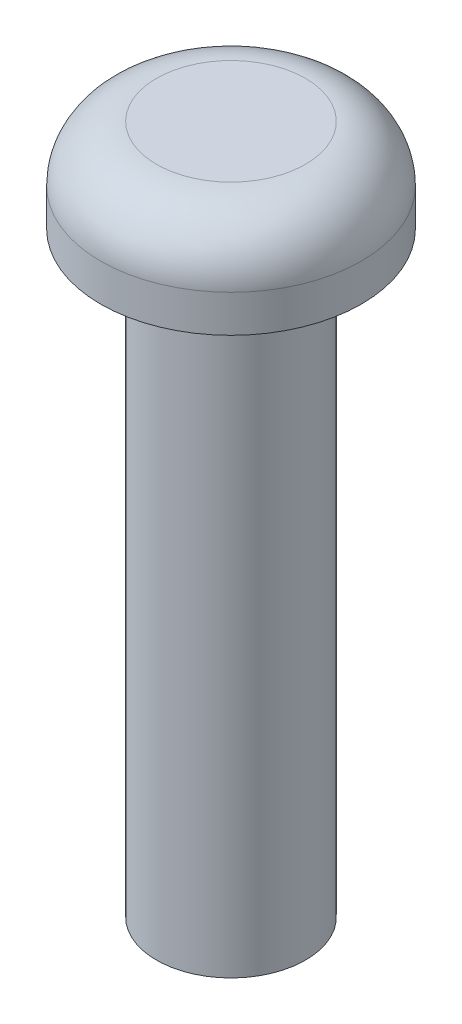
ISO-10303-21;
HEADER;
FILE_DESCRIPTION(('STEP AP214'),'2;1');
FILE_NAME('part.step','',(''),(''),'','','');
FILE_SCHEMA(('AUTOMOTIVE_DESIGN { 1 0 10303 214 1 1 1 1 }'));
ENDSEC;
DATA;
#1=APPLICATION_CONTEXT('core data for automotive mechanical design processes');
#2=APPLICATION_PROTOCOL_DEFINITION('international standard','automotive_design',2000,#1);
#3=PRODUCT_CONTEXT('',#1,'mechanical');
#4=PRODUCT('Part','Part','',(#3));
#5=PRODUCT_RELATED_PRODUCT_CATEGORY('part','',(#4));
#6=PRODUCT_DEFINITION_FORMATION('','',#4);
#7=PRODUCT_DEFINITION_CONTEXT('part definition',#1,'design');
#8=PRODUCT_DEFINITION('design','',#6,#7);
#9=PRODUCT_DEFINITION_SHAPE('','',#8);
#10=(LENGTH_UNIT() NAMED_UNIT(*) SI_UNIT(.MILLI.,.METRE.));
#11=(NAMED_UNIT(*) PLANE_ANGLE_UNIT() SI_UNIT($,.RADIAN.));
#12=(NAMED_UNIT(*) SI_UNIT($,.STERADIAN.) SOLID_ANGLE_UNIT());
#13=UNCERTAINTY_MEASURE_WITH_UNIT(LENGTH_MEASURE(1.E-05),#10,'distance_accuracy_value','');
#14=(GEOMETRIC_REPRESENTATION_CONTEXT(3) GLOBAL_UNCERTAINTY_ASSIGNED_CONTEXT((#13)) GLOBAL_UNIT_ASSIGNED_CONTEXT((#10,
#11,#12)) REPRESENTATION_CONTEXT('',''));
#15=CARTESIAN_POINT('',(0.,0.,0.));
#16=DIRECTION('',(0.,0.,1.));
#17=DIRECTION('',(1.,0.,0.));
#18=AXIS2_PLACEMENT_3D('',#15,#16,#17);
#19=CARTESIAN_POINT('',(0.,-16.,0.));
#20=DIRECTION('',(0.,-1.,0.));
#21=DIRECTION('',(0.,0.,-1.));
#22=AXIS2_PLACEMENT_3D('',#19,#20,#21);
#23=CYLINDRICAL_SURFACE('',#22,2.);
#24=CARTESIAN_POINT('',(0.,0.,0.));
#25=DIRECTION('',(0.,-1.,0.));
#26=DIRECTION('',(0.,0.,-1.));
#27=AXIS2_PLACEMENT_3D('',#24,#25,#26);
#28=CIRCLE('',#27,2.);
#29=CARTESIAN_POINT('',(0.,0.,-2.));
#30=VERTEX_POINT('',#29);
#31=EDGE_CURVE('E10',#30,#30,#28,.T.);
#32=ORIENTED_EDGE('',*,*,#31,.T.);
#33=EDGE_LOOP('',(#32));
#34=FACE_BOUND('',#33,.T.);
#35=CARTESIAN_POINT('',(0.,-16.,0.));
#36=DIRECTION('',(0.,-1.,0.));
#37=DIRECTION('',(0.,0.,-1.));
#38=AXIS2_PLACEMENT_3D('',#35,#36,#37);
#39=CIRCLE('',#38,2.);
#40=CARTESIAN_POINT('',(0.,-16.,-2.));
#41=VERTEX_POINT('',#40);
#42=EDGE_CURVE('E50',#41,#41,#39,.T.);
#43=ORIENTED_EDGE('',*,*,#42,.F.);
#44=EDGE_LOOP('',(#43));
#45=FACE_BOUND('',#44,.T.);
#46=ADVANCED_FACE('F31',(#34,#45),#23,.T.);
#47=CARTESIAN_POINT('',(2.,0.,0.));
#48=DIRECTION('',(0.,-1.,0.));
#49=DIRECTION('',(0.,0.,-1.));
#50=AXIS2_PLACEMENT_3D('',#47,#48,#49);
#51=PLANE('',#50);
#52=CARTESIAN_POINT('',(0.,0.,0.));
#53=DIRECTION('',(0.,-1.,0.));
#54=DIRECTION('',(0.,0.,-1.));
#55=AXIS2_PLACEMENT_3D('',#52,#53,#54);
#56=CIRCLE('',#55,3.5);
#57=CARTESIAN_POINT('',(0.,0.,-3.5));
#58=VERTEX_POINT('',#57);
#59=EDGE_CURVE('E37',#58,#58,#56,.T.);
#60=ORIENTED_EDGE('',*,*,#59,.T.);
#61=EDGE_LOOP('',(#60));
#62=FACE_BOUND('',#61,.T.);
#63=ORIENTED_EDGE('',*,*,#31,.F.);
#64=EDGE_LOOP('',(#63));
#65=FACE_BOUND('',#64,.T.);
#66=ADVANCED_FACE('F57',(#62,#65),#51,.T.);
#67=CARTESIAN_POINT('',(0.,-16.,0.));
#68=DIRECTION('',(0.,-1.,0.));
#69=DIRECTION('',(0.,0.,-1.));
#70=AXIS2_PLACEMENT_3D('',#67,#68,#69);
#71=CYLINDRICAL_SURFACE('',#70,3.5);
#72=CARTESIAN_POINT('',(0.,1.,0.));
#73=DIRECTION('',(0.,-1.,0.));
#74=DIRECTION('',(0.,0.,-1.));
#75=AXIS2_PLACEMENT_3D('',#72,#73,#74);
#76=CIRCLE('',#75,3.5);
#77=CARTESIAN_POINT('',(0.,1.,-3.5));
#78=VERTEX_POINT('',#77);
#79=EDGE_CURVE('E41',#78,#78,#76,.T.);
#80=ORIENTED_EDGE('',*,*,#79,.T.);
#81=EDGE_LOOP('',(#80));
#82=FACE_BOUND('',#81,.T.);
#83=ORIENTED_EDGE('',*,*,#59,.F.);
#84=EDGE_LOOP('',(#83));
#85=FACE_BOUND('',#84,.T.);
#86=ADVANCED_FACE('F61',(#82,#85),#71,.T.);
#87=CARTESIAN_POINT('',(0.,1.,0.));
#88=DIRECTION('',(0.,-1.,0.));
#89=DIRECTION('',(0.,0.,-1.));
#90=AXIS2_PLACEMENT_3D('',#87,#88,#89);
#91=TOROIDAL_SURFACE('',#90,2.,1.5);
#92=CARTESIAN_POINT('',(0.,2.5,0.));
#93=DIRECTION('',(0.,-1.,0.));
#94=DIRECTION('',(0.,0.,-1.));
#95=AXIS2_PLACEMENT_3D('',#92,#93,#94);
#96=CIRCLE('',#95,2.);
#97=CARTESIAN_POINT('',(0.,2.5,-2.));
#98=VERTEX_POINT('',#97);
#99=EDGE_CURVE('E45',#98,#98,#96,.T.);
#100=ORIENTED_EDGE('',*,*,#99,.T.);
#101=EDGE_LOOP('',(#100));
#102=FACE_BOUND('',#101,.T.);
#103=ORIENTED_EDGE('',*,*,#79,.F.);
#104=EDGE_LOOP('',(#103));
#105=FACE_BOUND('',#104,.T.);
#106=ADVANCED_FACE('F65',(#102,#105),#91,.T.);
#107=CARTESIAN_POINT('',(2.,2.5,0.));
#108=DIRECTION('',(0.,1.,0.));
#109=DIRECTION('',(0.,0.,1.));
#110=AXIS2_PLACEMENT_3D('',#107,#108,#109);
#111=PLANE('',#110);
#112=ORIENTED_EDGE('',*,*,#99,.F.);
#113=EDGE_LOOP('',(#112));
#114=FACE_BOUND('',#113,.T.);
#115=ADVANCED_FACE('F72',(#114),#111,.T.);
#116=CARTESIAN_POINT('',(2.,-16.,0.));
#117=DIRECTION('',(0.,-1.,0.));
#118=DIRECTION('',(0.,0.,-1.));
#119=AXIS2_PLACEMENT_3D('',#116,#117,#118);
#120=PLANE('',#119);
#121=ORIENTED_EDGE('',*,*,#42,.T.);
#122=EDGE_LOOP('',(#121));
#123=FACE_BOUND('',#122,.T.);
#124=ADVANCED_FACE('F54',(#123),#120,.T.);
#125=CLOSED_SHELL('',(#46,#66,#86,#106,#115,#124));
#126=MANIFOLD_SOLID_BREP('B2',#125);
#127=ADVANCED_BREP_SHAPE_REPRESENTATION('',(#18,#126),#14);
#128=SHAPE_DEFINITION_REPRESENTATION(#9,#127);
ENDSEC;
END-ISO-10303-21;
